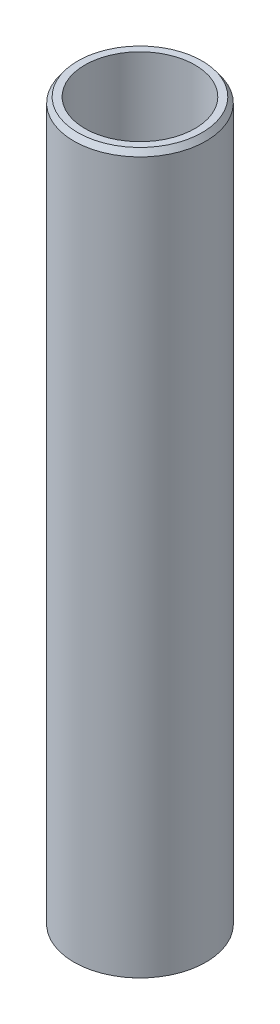
ISO-10303-21;
HEADER;
FILE_DESCRIPTION(('STEP AP214'),'2;1');
FILE_NAME('part.step','',(''),(''),'','','');
FILE_SCHEMA(('AUTOMOTIVE_DESIGN { 1 0 10303 214 1 1 1 1 }'));
ENDSEC;
DATA;
#1=APPLICATION_CONTEXT('core data for automotive mechanical design processes');
#2=APPLICATION_PROTOCOL_DEFINITION('international standard','automotive_design',2000,#1);
#3=PRODUCT_CONTEXT('',#1,'mechanical');
#4=PRODUCT('Part','Part','',(#3));
#5=PRODUCT_RELATED_PRODUCT_CATEGORY('part','',(#4));
#6=PRODUCT_DEFINITION_FORMATION('','',#4);
#7=PRODUCT_DEFINITION_CONTEXT('part definition',#1,'design');
#8=PRODUCT_DEFINITION('design','',#6,#7);
#9=PRODUCT_DEFINITION_SHAPE('','',#8);
#10=(LENGTH_UNIT() NAMED_UNIT(*) SI_UNIT(.MILLI.,.METRE.));
#11=(NAMED_UNIT(*) PLANE_ANGLE_UNIT() SI_UNIT($,.RADIAN.));
#12=(NAMED_UNIT(*) SI_UNIT($,.STERADIAN.) SOLID_ANGLE_UNIT());
#13=UNCERTAINTY_MEASURE_WITH_UNIT(LENGTH_MEASURE(1.E-05),#10,'distance_accuracy_value','');
#14=(GEOMETRIC_REPRESENTATION_CONTEXT(3) GLOBAL_UNCERTAINTY_ASSIGNED_CONTEXT((#13)) GLOBAL_UNIT_ASSIGNED_CONTEXT((#10,
#11,#12)) REPRESENTATION_CONTEXT('',''));
#15=CARTESIAN_POINT('',(0.,0.,0.));
#16=DIRECTION('',(0.,0.,1.));
#17=DIRECTION('',(1.,0.,0.));
#18=AXIS2_PLACEMENT_3D('',#15,#16,#17);
#19=CARTESIAN_POINT('',(0.,600.,0.));
#20=DIRECTION('',(0.,-1.,0.));
#21=DIRECTION('',(0.,0.,-1.));
#22=AXIS2_PLACEMENT_3D('',#19,#20,#21);
#23=CYLINDRICAL_SURFACE('',#22,55.);
#24=CARTESIAN_POINT('',(0.,595.465031089009,0.));
#25=DIRECTION('',(0.,1.,0.));
#26=DIRECTION('',(0.,0.,1.));
#27=AXIS2_PLACEMENT_3D('',#24,#25,#26);
#28=CIRCLE('',#27,55.);
#29=CARTESIAN_POINT('',(0.,595.465031089009,55.));
#30=VERTEX_POINT('',#29);
#31=EDGE_CURVE('E50',#30,#30,#28,.F.);
#32=ORIENTED_EDGE('',*,*,#31,.T.);
#33=EDGE_LOOP('',(#32));
#34=FACE_BOUND('',#33,.T.);
#35=CARTESIAN_POINT('',(0.,3.2376710345895,0.));
#36=DIRECTION('',(0.,1.,0.));
#37=DIRECTION('',(0.,0.,1.));
#38=AXIS2_PLACEMENT_3D('',#35,#36,#37);
#39=CIRCLE('',#38,55.);
#40=CARTESIAN_POINT('',(0.,3.2376710345895,55.));
#41=VERTEX_POINT('',#40);
#42=EDGE_CURVE('E51',#41,#41,#39,.T.);
#43=ORIENTED_EDGE('',*,*,#42,.T.);
#44=EDGE_LOOP('',(#43));
#45=FACE_BOUND('',#44,.T.);
#46=ADVANCED_FACE('F39',(#34,#45),#23,.T.);
#47=CARTESIAN_POINT('',(0.,600.,0.));
#48=DIRECTION('',(0.,1.,0.));
#49=DIRECTION('',(0.,0.,1.));
#50=AXIS2_PLACEMENT_3D('',#47,#48,#49);
#51=PLANE('',#50);
#52=CARTESIAN_POINT('',(0.,600.,0.));
#53=DIRECTION('',(0.,1.,0.));
#54=DIRECTION('',(0.,0.,1.));
#55=AXIS2_PLACEMENT_3D('',#52,#53,#54);
#56=CIRCLE('',#55,51.7623289654104);
#57=CARTESIAN_POINT('',(0.,600.,51.7623289654104));
#58=VERTEX_POINT('',#57);
#59=EDGE_CURVE('E54',#58,#58,#56,.T.);
#60=ORIENTED_EDGE('',*,*,#59,.T.);
#61=EDGE_LOOP('',(#60));
#62=FACE_BOUND('',#61,.T.);
#63=CARTESIAN_POINT('',(0.,600.,0.));
#64=DIRECTION('',(0.,1.,0.));
#65=DIRECTION('',(0.,0.,1.));
#66=AXIS2_PLACEMENT_3D('',#63,#64,#65);
#67=CIRCLE('',#66,45.8765058865177);
#68=CARTESIAN_POINT('',(0.,600.,45.8765058865177));
#69=VERTEX_POINT('',#68);
#70=EDGE_CURVE('E58',#69,#69,#67,.T.);
#71=ORIENTED_EDGE('',*,*,#70,.F.);
#72=EDGE_LOOP('',(#71));
#73=FACE_BOUND('',#72,.T.);
#74=ADVANCED_FACE('F69',(#62,#73),#51,.T.);
#75=CARTESIAN_POINT('',(0.,0.,0.));
#76=DIRECTION('',(0.,1.,0.));
#77=DIRECTION('',(0.,0.,1.));
#78=AXIS2_PLACEMENT_3D('',#75,#76,#77);
#79=PLANE('',#78);
#80=CARTESIAN_POINT('',(0.,0.,0.));
#81=DIRECTION('',(0.,1.,0.));
#82=DIRECTION('',(0.,0.,1.));
#83=AXIS2_PLACEMENT_3D('',#80,#81,#82);
#84=CIRCLE('',#83,50.4650310890091);
#85=CARTESIAN_POINT('',(0.,0.,50.4650310890091));
#86=VERTEX_POINT('',#85);
#87=EDGE_CURVE('E10',#86,#86,#84,.F.);
#88=ORIENTED_EDGE('',*,*,#87,.T.);
#89=EDGE_LOOP('',(#88));
#90=FACE_BOUND('',#89,.T.);
#91=CARTESIAN_POINT('',(0.,0.,0.));
#92=DIRECTION('',(0.,1.,0.));
#93=DIRECTION('',(0.,0.,1.));
#94=AXIS2_PLACEMENT_3D('',#91,#92,#93);
#95=CIRCLE('',#94,45.8765058865177);
#96=CARTESIAN_POINT('',(0.,0.,45.8765058865177));
#97=VERTEX_POINT('',#96);
#98=EDGE_CURVE('E63',#97,#97,#95,.T.);
#99=ORIENTED_EDGE('',*,*,#98,.T.);
#100=EDGE_LOOP('',(#99));
#101=FACE_BOUND('',#100,.T.);
#102=ADVANCED_FACE('F75',(#90,#101),#79,.F.);
#103=CARTESIAN_POINT('',(0.,600.,0.));
#104=DIRECTION('',(0.,-1.,0.));
#105=DIRECTION('',(0.,0.,-1.));
#106=AXIS2_PLACEMENT_3D('',#103,#104,#105);
#107=CYLINDRICAL_SURFACE('',#106,45.8765058865177);
#108=ORIENTED_EDGE('',*,*,#70,.T.);
#109=EDGE_LOOP('',(#108));
#110=FACE_BOUND('',#109,.T.);
#111=ORIENTED_EDGE('',*,*,#98,.F.);
#112=EDGE_LOOP('',(#111));
#113=FACE_BOUND('',#112,.T.);
#114=ADVANCED_FACE('F70',(#110,#113),#107,.F.);
#115=CARTESIAN_POINT('',(0.,600.,0.));
#116=DIRECTION('',(0.,-1.,0.));
#117=DIRECTION('',(0.,0.,-1.));
#118=AXIS2_PLACEMENT_3D('',#115,#116,#117);
#119=CONICAL_SURFACE('',#118,51.7623289654104,0.620016926355034);
#120=ORIENTED_EDGE('',*,*,#31,.F.);
#121=EDGE_LOOP('',(#120));
#122=FACE_BOUND('',#121,.T.);
#123=ORIENTED_EDGE('',*,*,#59,.F.);
#124=EDGE_LOOP('',(#123));
#125=FACE_BOUND('',#124,.T.);
#126=ADVANCED_FACE('F81',(#122,#125),#119,.T.);
#127=CARTESIAN_POINT('',(0.,3.2376710345895,0.));
#128=DIRECTION('',(0.,1.,0.));
#129=DIRECTION('',(0.,0.,1.));
#130=AXIS2_PLACEMENT_3D('',#127,#128,#129);
#131=CONICAL_SURFACE('',#130,55.,0.950779400439855);
#132=ORIENTED_EDGE('',*,*,#87,.F.);
#133=EDGE_LOOP('',(#132));
#134=FACE_BOUND('',#133,.T.);
#135=ORIENTED_EDGE('',*,*,#42,.F.);
#136=EDGE_LOOP('',(#135));
#137=FACE_BOUND('',#136,.T.);
#138=ADVANCED_FACE('F45',(#134,#137),#131,.T.);
#139=CLOSED_SHELL('',(#46,#74,#102,#114,#126,#138));
#140=MANIFOLD_SOLID_BREP('B2',#139);
#141=ADVANCED_BREP_SHAPE_REPRESENTATION('',(#18,#140),#14);
#142=SHAPE_DEFINITION_REPRESENTATION(#9,#141);
ENDSEC;
END-ISO-10303-21;
